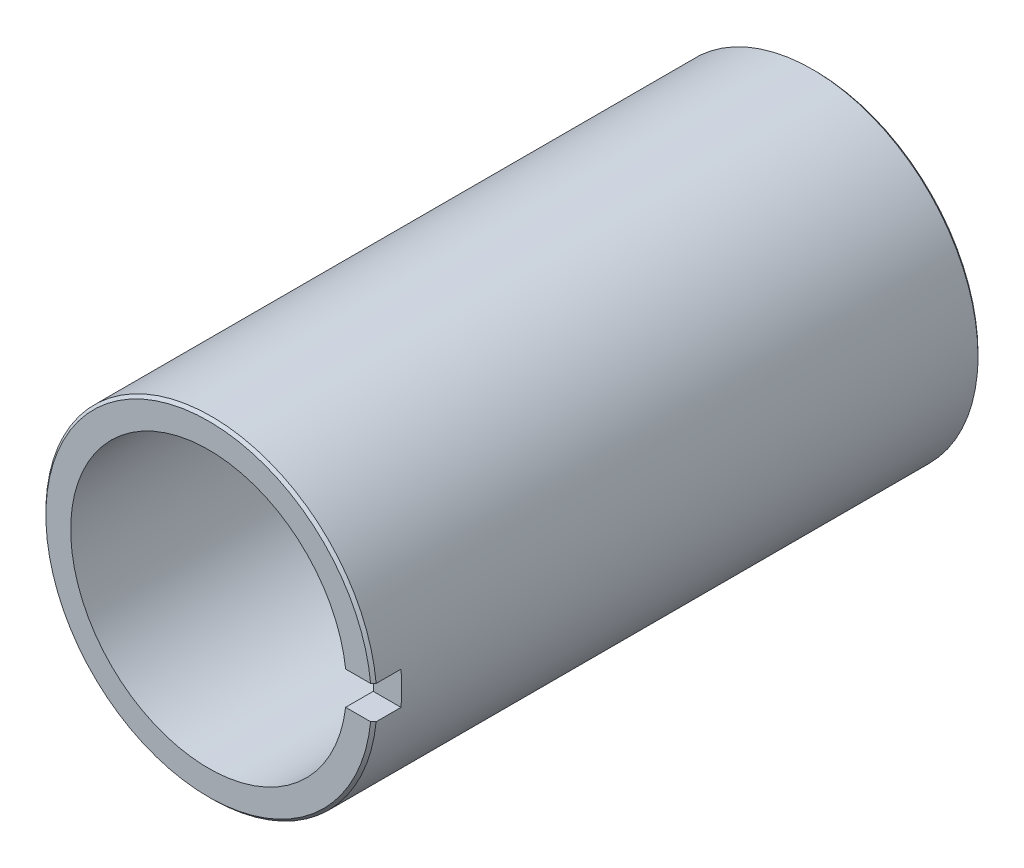
ISO-10303-21;
HEADER;
FILE_DESCRIPTION(('STEP AP214'),'2;1');
FILE_NAME('part.step','',(''),(''),'','','');
FILE_SCHEMA(('AUTOMOTIVE_DESIGN { 1 0 10303 214 1 1 1 1 }'));
ENDSEC;
DATA;
#1=APPLICATION_CONTEXT('core data for automotive mechanical design processes');
#2=APPLICATION_PROTOCOL_DEFINITION('international standard','automotive_design',2000,#1);
#3=PRODUCT_CONTEXT('',#1,'mechanical');
#4=PRODUCT('Part','Part','',(#3));
#5=PRODUCT_RELATED_PRODUCT_CATEGORY('part','',(#4));
#6=PRODUCT_DEFINITION_FORMATION('','',#4);
#7=PRODUCT_DEFINITION_CONTEXT('part definition',#1,'design');
#8=PRODUCT_DEFINITION('design','',#6,#7);
#9=PRODUCT_DEFINITION_SHAPE('','',#8);
#10=(LENGTH_UNIT() NAMED_UNIT(*) SI_UNIT(.MILLI.,.METRE.));
#11=(NAMED_UNIT(*) PLANE_ANGLE_UNIT() SI_UNIT($,.RADIAN.));
#12=(NAMED_UNIT(*) SI_UNIT($,.STERADIAN.) SOLID_ANGLE_UNIT());
#13=UNCERTAINTY_MEASURE_WITH_UNIT(LENGTH_MEASURE(1.E-05),#10,'distance_accuracy_value','');
#14=(GEOMETRIC_REPRESENTATION_CONTEXT(3) GLOBAL_UNCERTAINTY_ASSIGNED_CONTEXT((#13)) GLOBAL_UNIT_ASSIGNED_CONTEXT((#10,
#11,#12)) REPRESENTATION_CONTEXT('',''));
#15=CARTESIAN_POINT('',(0.,0.,0.));
#16=DIRECTION('',(0.,0.,1.));
#17=DIRECTION('',(1.,0.,0.));
#18=AXIS2_PLACEMENT_3D('',#15,#16,#17);
#19=CARTESIAN_POINT('',(0.,0.,109.9));
#20=DIRECTION('',(0.,0.,1.));
#21=DIRECTION('',(1.,0.,0.));
#22=AXIS2_PLACEMENT_3D('',#19,#20,#21);
#23=PLANE('',#22);
#24=DIRECTION('',(-1.,0.,0.));
#25=VECTOR('',#24,1.);
#26=CARTESIAN_POINT('',(30.,3.,109.9));
#27=LINE('',#26,#25);
#28=CARTESIAN_POINT('',(29.3470611816584,3.,109.9));
#29=VERTEX_POINT('',#28);
#30=CARTESIAN_POINT('',(24.8193472919817,3.,109.9));
#31=VERTEX_POINT('',#30);
#32=EDGE_CURVE('E103',#29,#31,#27,.T.);
#33=ORIENTED_EDGE('',*,*,#32,.F.);
#34=CARTESIAN_POINT('',(0.,0.,109.9));
#35=DIRECTION('',(0.,0.,1.));
#36=DIRECTION('',(1.,0.,0.));
#37=AXIS2_PLACEMENT_3D('',#34,#35,#36);
#38=CIRCLE('',#37,29.5);
#39=CARTESIAN_POINT('',(29.3470611816584,-3.,109.9));
#40=VERTEX_POINT('',#39);
#41=EDGE_CURVE('E124',#29,#40,#38,.T.);
#42=ORIENTED_EDGE('',*,*,#41,.T.);
#43=DIRECTION('',(-1.,0.,0.));
#44=VECTOR('',#43,1.);
#45=CARTESIAN_POINT('',(30.,-3.,109.9));
#46=LINE('',#45,#44);
#47=CARTESIAN_POINT('',(24.8193472919817,-3.,109.9));
#48=VERTEX_POINT('',#47);
#49=EDGE_CURVE('E106',#40,#48,#46,.T.);
#50=ORIENTED_EDGE('',*,*,#49,.T.);
#51=CARTESIAN_POINT('',(0.,0.,109.9));
#52=DIRECTION('',(0.,0.,1.));
#53=DIRECTION('',(1.,0.,0.));
#54=AXIS2_PLACEMENT_3D('',#51,#52,#53);
#55=CIRCLE('',#54,25.);
#56=EDGE_CURVE('E113',#31,#48,#55,.T.);
#57=ORIENTED_EDGE('',*,*,#56,.F.);
#58=EDGE_LOOP('',(#33,#42,#50,#57));
#59=FACE_BOUND('',#58,.T.);
#60=ADVANCED_FACE('F38',(#59),#23,.T.);
#61=CARTESIAN_POINT('',(0.,0.,109.9));
#62=DIRECTION('',(0.,0.,-1.));
#63=DIRECTION('',(-1.,0.,0.));
#64=AXIS2_PLACEMENT_3D('',#61,#62,#63);
#65=CYLINDRICAL_SURFACE('',#64,30.);
#66=CARTESIAN_POINT('',(0.,0.,0.500000000000084));
#67=DIRECTION('',(0.,0.,1.));
#68=DIRECTION('',(1.,0.,0.));
#69=AXIS2_PLACEMENT_3D('',#66,#67,#68);
#70=CIRCLE('',#69,30.);
#71=CARTESIAN_POINT('',(30.,0.,0.500000000000084));
#72=VERTEX_POINT('',#71);
#73=EDGE_CURVE('E133',#72,#72,#70,.T.);
#74=ORIENTED_EDGE('',*,*,#73,.T.);
#75=EDGE_LOOP('',(#74));
#76=FACE_BOUND('',#75,.T.);
#77=DIRECTION('',(0.,0.,-1.));
#78=VECTOR('',#77,1.);
#79=CARTESIAN_POINT('',(29.8496231131986,-3.,109.9));
#80=LINE('',#79,#78);
#81=CARTESIAN_POINT('',(29.8496231131986,-3.,109.4));
#82=VERTEX_POINT('',#81);
#83=CARTESIAN_POINT('',(29.8496231131986,-3.,104.9));
#84=VERTEX_POINT('',#83);
#85=EDGE_CURVE('E95',#82,#84,#80,.T.);
#86=ORIENTED_EDGE('',*,*,#85,.F.);
#87=CARTESIAN_POINT('',(0.,0.,109.4));
#88=DIRECTION('',(0.,0.,1.));
#89=DIRECTION('',(1.,0.,0.));
#90=AXIS2_PLACEMENT_3D('',#87,#88,#89);
#91=CIRCLE('',#90,30.);
#92=CARTESIAN_POINT('',(29.8496231131986,3.,109.4));
#93=VERTEX_POINT('',#92);
#94=EDGE_CURVE('E54',#82,#93,#91,.F.);
#95=ORIENTED_EDGE('',*,*,#94,.T.);
#96=DIRECTION('',(0.,0.,-1.));
#97=VECTOR('',#96,1.);
#98=CARTESIAN_POINT('',(29.8496231131986,3.,109.9));
#99=LINE('',#98,#97);
#100=CARTESIAN_POINT('',(29.8496231131986,3.,104.9));
#101=VERTEX_POINT('',#100);
#102=EDGE_CURVE('E96',#101,#93,#99,.F.);
#103=ORIENTED_EDGE('',*,*,#102,.F.);
#104=CARTESIAN_POINT('',(0.,0.,104.9));
#105=DIRECTION('',(0.,0.,1.));
#106=DIRECTION('',(1.,0.,0.));
#107=AXIS2_PLACEMENT_3D('',#104,#105,#106);
#108=CIRCLE('',#107,30.);
#109=EDGE_CURVE('E88',#84,#101,#108,.T.);
#110=ORIENTED_EDGE('',*,*,#109,.F.);
#111=EDGE_LOOP('',(#86,#95,#103,#110));
#112=FACE_BOUND('',#111,.T.);
#113=ADVANCED_FACE('F105',(#76,#112),#65,.T.);
#114=CARTESIAN_POINT('',(0.,0.,109.9));
#115=DIRECTION('',(0.,0.,-1.));
#116=DIRECTION('',(-1.,0.,0.));
#117=AXIS2_PLACEMENT_3D('',#114,#115,#116);
#118=CYLINDRICAL_SURFACE('',#117,25.);
#119=CARTESIAN_POINT('',(0.,0.,0.));
#120=DIRECTION('',(0.,0.,1.));
#121=DIRECTION('',(1.,0.,0.));
#122=AXIS2_PLACEMENT_3D('',#119,#120,#121);
#123=CIRCLE('',#122,25.);
#124=CARTESIAN_POINT('',(25.,0.,0.));
#125=VERTEX_POINT('',#124);
#126=EDGE_CURVE('E112',#125,#125,#123,.T.);
#127=ORIENTED_EDGE('',*,*,#126,.F.);
#128=EDGE_LOOP('',(#127));
#129=FACE_BOUND('',#128,.T.);
#130=ORIENTED_EDGE('',*,*,#56,.T.);
#131=DIRECTION('',(0.,0.,-1.));
#132=VECTOR('',#131,1.);
#133=CARTESIAN_POINT('',(24.8193472919817,-3.,109.9));
#134=LINE('',#133,#132);
#135=CARTESIAN_POINT('',(24.8193472919817,-3.,104.9));
#136=VERTEX_POINT('',#135);
#137=EDGE_CURVE('E121',#48,#136,#134,.T.);
#138=ORIENTED_EDGE('',*,*,#137,.T.);
#139=CARTESIAN_POINT('',(0.,0.,104.9));
#140=DIRECTION('',(0.,0.,1.));
#141=DIRECTION('',(1.,0.,0.));
#142=AXIS2_PLACEMENT_3D('',#139,#140,#141);
#143=CIRCLE('',#142,25.);
#144=CARTESIAN_POINT('',(24.8193472919817,3.,104.9));
#145=VERTEX_POINT('',#144);
#146=EDGE_CURVE('E119',#136,#145,#143,.T.);
#147=ORIENTED_EDGE('',*,*,#146,.T.);
#148=DIRECTION('',(0.,0.,-1.));
#149=VECTOR('',#148,1.);
#150=CARTESIAN_POINT('',(24.8193472919817,3.,109.9));
#151=LINE('',#150,#149);
#152=EDGE_CURVE('E102',#145,#31,#151,.F.);
#153=ORIENTED_EDGE('',*,*,#152,.T.);
#154=EDGE_LOOP('',(#130,#138,#147,#153));
#155=FACE_BOUND('',#154,.T.);
#156=ADVANCED_FACE('F167',(#129,#155),#118,.F.);
#157=CARTESIAN_POINT('',(0.,0.,0.));
#158=DIRECTION('',(0.,0.,1.));
#159=DIRECTION('',(1.,0.,0.));
#160=AXIS2_PLACEMENT_3D('',#157,#158,#159);
#161=PLANE('',#160);
#162=CARTESIAN_POINT('',(0.,0.,0.));
#163=DIRECTION('',(0.,0.,1.));
#164=DIRECTION('',(1.,0.,0.));
#165=AXIS2_PLACEMENT_3D('',#162,#163,#164);
#166=CIRCLE('',#165,29.4999999999999);
#167=CARTESIAN_POINT('',(29.4999999999999,0.,0.));
#168=VERTEX_POINT('',#167);
#169=EDGE_CURVE('E11',#168,#168,#166,.F.);
#170=ORIENTED_EDGE('',*,*,#169,.T.);
#171=EDGE_LOOP('',(#170));
#172=FACE_BOUND('',#171,.T.);
#173=ORIENTED_EDGE('',*,*,#126,.T.);
#174=EDGE_LOOP('',(#173));
#175=FACE_BOUND('',#174,.T.);
#176=ADVANCED_FACE('F160',(#172,#175),#161,.F.);
#177=CARTESIAN_POINT('',(30.,-3.,109.9));
#178=DIRECTION('',(0.,1.,0.));
#179=DIRECTION('',(0.,0.,1.));
#180=AXIS2_PLACEMENT_3D('',#177,#178,#179);
#181=PLANE('',#180);
#182=ORIENTED_EDGE('',*,*,#49,.F.);
#183=CARTESIAN_POINT('',(29.3470611816584,-3.,109.9));
#184=CARTESIAN_POINT('',(29.4308251008671,-3.,109.816670282383));
#185=CARTESIAN_POINT('',(29.5145872214333,-3.,109.733338756908));
#186=CARTESIAN_POINT('',(29.68210786528,-3.,109.566672090242));
#187=CARTESIAN_POINT('',(29.7658663885606,-3.,109.48333694905));
#188=CARTESIAN_POINT('',(29.8496231131986,-3.,109.4));
#189=B_SPLINE_CURVE_WITH_KNOTS('',3,(#183,#184,#185,#186,#187,#188),.UNSPECIFIED.,.F.,.F.,(4,2,
4),(0.,0.354460327565506,0.70892065512824),.UNSPECIFIED.);
#190=EDGE_CURVE('E62',#40,#82,#189,.T.);
#191=ORIENTED_EDGE('',*,*,#190,.T.);
#192=ORIENTED_EDGE('',*,*,#85,.T.);
#193=DIRECTION('',(-1.,0.,0.));
#194=VECTOR('',#193,1.);
#195=CARTESIAN_POINT('',(30.,-3.,104.9));
#196=LINE('',#195,#194);
#197=EDGE_CURVE('E94',#84,#136,#196,.T.);
#198=ORIENTED_EDGE('',*,*,#197,.T.);
#199=ORIENTED_EDGE('',*,*,#137,.F.);
#200=EDGE_LOOP('',(#182,#191,#192,#198,#199));
#201=FACE_BOUND('',#200,.T.);
#202=ADVANCED_FACE('F135',(#201),#181,.T.);
#203=CARTESIAN_POINT('',(30.,3.,104.9));
#204=DIRECTION('',(0.,0.,1.));
#205=DIRECTION('',(1.,0.,0.));
#206=AXIS2_PLACEMENT_3D('',#203,#204,#205);
#207=PLANE('',#206);
#208=ORIENTED_EDGE('',*,*,#109,.T.);
#209=DIRECTION('',(-1.,0.,0.));
#210=VECTOR('',#209,1.);
#211=CARTESIAN_POINT('',(30.,3.,104.9));
#212=LINE('',#211,#210);
#213=EDGE_CURVE('E91',#101,#145,#212,.T.);
#214=ORIENTED_EDGE('',*,*,#213,.T.);
#215=ORIENTED_EDGE('',*,*,#146,.F.);
#216=ORIENTED_EDGE('',*,*,#197,.F.);
#217=EDGE_LOOP('',(#208,#214,#215,#216));
#218=FACE_BOUND('',#217,.T.);
#219=ADVANCED_FACE('F90',(#218),#207,.T.);
#220=CARTESIAN_POINT('',(30.,3.,109.9));
#221=DIRECTION('',(0.,-1.,0.));
#222=DIRECTION('',(0.,0.,-1.));
#223=AXIS2_PLACEMENT_3D('',#220,#221,#222);
#224=PLANE('',#223);
#225=ORIENTED_EDGE('',*,*,#102,.T.);
#226=CARTESIAN_POINT('',(29.8496231131986,3.,109.4));
#227=CARTESIAN_POINT('',(29.7658663885606,3.,109.48333694905));
#228=CARTESIAN_POINT('',(29.68210786528,3.,109.566672090242));
#229=CARTESIAN_POINT('',(29.5145872214333,3.,109.733338756908));
#230=CARTESIAN_POINT('',(29.4308251008671,3.,109.816670282383));
#231=CARTESIAN_POINT('',(29.3470611816584,3.,109.9));
#232=B_SPLINE_CURVE_WITH_KNOTS('',3,(#226,#227,#228,#229,#230,#231),.UNSPECIFIED.,.F.,.F.,(4,2,
4),(0.,0.354460327562736,0.708920655128242),.UNSPECIFIED.);
#233=EDGE_CURVE('E47',#93,#29,#232,.T.);
#234=ORIENTED_EDGE('',*,*,#233,.T.);
#235=ORIENTED_EDGE('',*,*,#32,.T.);
#236=ORIENTED_EDGE('',*,*,#152,.F.);
#237=ORIENTED_EDGE('',*,*,#213,.F.);
#238=EDGE_LOOP('',(#225,#234,#235,#236,#237));
#239=FACE_BOUND('',#238,.T.);
#240=ADVANCED_FACE('F99',(#239),#224,.T.);
#241=CARTESIAN_POINT('',(0.,0.,109.9));
#242=DIRECTION('',(0.,0.,-1.));
#243=DIRECTION('',(-1.,0.,0.));
#244=AXIS2_PLACEMENT_3D('',#241,#242,#243);
#245=CONICAL_SURFACE('',#244,29.5,0.785398163397448);
#246=ORIENTED_EDGE('',*,*,#233,.F.);
#247=ORIENTED_EDGE('',*,*,#94,.F.);
#248=ORIENTED_EDGE('',*,*,#190,.F.);
#249=ORIENTED_EDGE('',*,*,#41,.F.);
#250=EDGE_LOOP('',(#246,#247,#248,#249));
#251=FACE_BOUND('',#250,.T.);
#252=ADVANCED_FACE('F140',(#251),#245,.T.);
#253=CARTESIAN_POINT('',(0.,0.,0.500000000000084));
#254=DIRECTION('',(0.,0.,1.));
#255=DIRECTION('',(1.,0.,0.));
#256=AXIS2_PLACEMENT_3D('',#253,#254,#255);
#257=CONICAL_SURFACE('',#256,30.,0.785398163397438);
#258=ORIENTED_EDGE('',*,*,#169,.F.);
#259=EDGE_LOOP('',(#258));
#260=FACE_BOUND('',#259,.T.);
#261=ORIENTED_EDGE('',*,*,#73,.F.);
#262=EDGE_LOOP('',(#261));
#263=FACE_BOUND('',#262,.T.);
#264=ADVANCED_FACE('F41',(#260,#263),#257,.T.);
#265=CLOSED_SHELL('',(#60,#113,#156,#176,#202,#219,#240,#252,#264));
#266=MANIFOLD_SOLID_BREP('B2',#265);
#267=ADVANCED_BREP_SHAPE_REPRESENTATION('',(#18,#266),#14);
#268=SHAPE_DEFINITION_REPRESENTATION(#9,#267);
ENDSEC;
END-ISO-10303-21;
